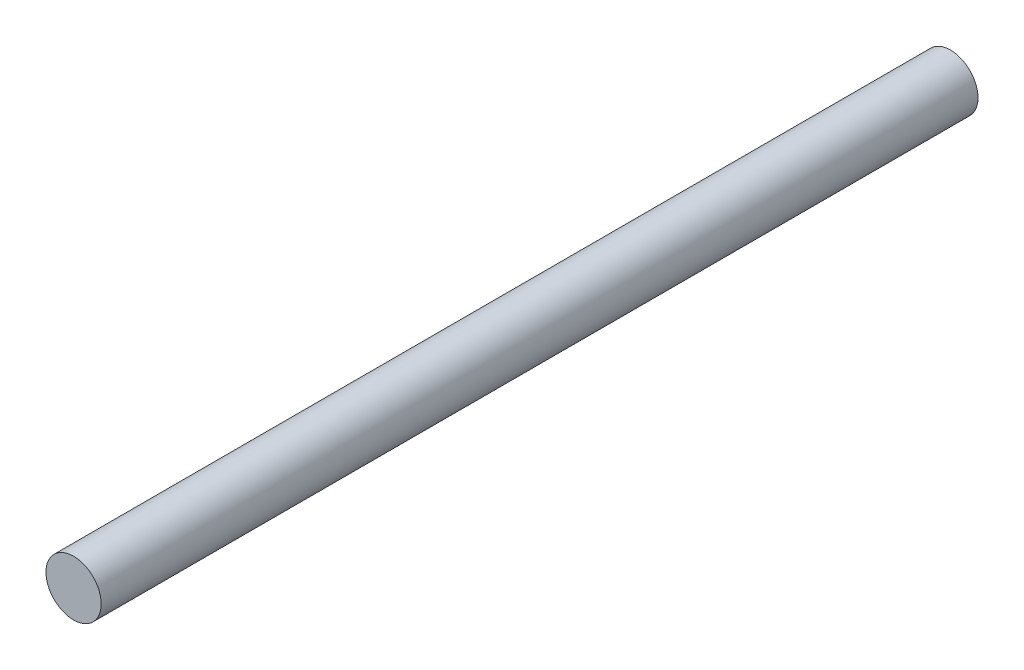
ISO-10303-21;
HEADER;
FILE_DESCRIPTION(('STEP AP214'),'2;1');
FILE_NAME('part.step','',(''),(''),'','','');
FILE_SCHEMA(('AUTOMOTIVE_DESIGN { 1 0 10303 214 1 1 1 1 }'));
ENDSEC;
DATA;
#1=APPLICATION_CONTEXT('core data for automotive mechanical design processes');
#2=APPLICATION_PROTOCOL_DEFINITION('international standard','automotive_design',2000,#1);
#3=PRODUCT_CONTEXT('',#1,'mechanical');
#4=PRODUCT('Part','Part','',(#3));
#5=PRODUCT_RELATED_PRODUCT_CATEGORY('part','',(#4));
#6=PRODUCT_DEFINITION_FORMATION('','',#4);
#7=PRODUCT_DEFINITION_CONTEXT('part definition',#1,'design');
#8=PRODUCT_DEFINITION('design','',#6,#7);
#9=PRODUCT_DEFINITION_SHAPE('','',#8);
#10=(LENGTH_UNIT() NAMED_UNIT(*) SI_UNIT(.MILLI.,.METRE.));
#11=(NAMED_UNIT(*) PLANE_ANGLE_UNIT() SI_UNIT($,.RADIAN.));
#12=(NAMED_UNIT(*) SI_UNIT($,.STERADIAN.) SOLID_ANGLE_UNIT());
#13=UNCERTAINTY_MEASURE_WITH_UNIT(LENGTH_MEASURE(1.E-05),#10,'distance_accuracy_value','');
#14=(GEOMETRIC_REPRESENTATION_CONTEXT(3) GLOBAL_UNCERTAINTY_ASSIGNED_CONTEXT((#13)) GLOBAL_UNIT_ASSIGNED_CONTEXT((#10,
#11,#12)) REPRESENTATION_CONTEXT('',''));
#15=CARTESIAN_POINT('',(0.,0.,0.));
#16=DIRECTION('',(0.,0.,1.));
#17=DIRECTION('',(1.,0.,0.));
#18=AXIS2_PLACEMENT_3D('',#15,#16,#17);
#19=CARTESIAN_POINT('',(0.,0.,127.));
#20=DIRECTION('',(0.,0.,-1.));
#21=DIRECTION('',(-1.,0.,0.));
#22=AXIS2_PLACEMENT_3D('',#19,#20,#21);
#23=CYLINDRICAL_SURFACE('',#22,4.);
#24=CARTESIAN_POINT('',(0.,0.,127.));
#25=DIRECTION('',(0.,0.,1.));
#26=DIRECTION('',(1.,0.,0.));
#27=AXIS2_PLACEMENT_3D('',#24,#25,#26);
#28=CIRCLE('',#27,4.);
#29=CARTESIAN_POINT('',(4.,0.,127.));
#30=VERTEX_POINT('',#29);
#31=EDGE_CURVE('E10',#30,#30,#28,.T.);
#32=ORIENTED_EDGE('',*,*,#31,.F.);
#33=EDGE_LOOP('',(#32));
#34=FACE_BOUND('',#33,.T.);
#35=CARTESIAN_POINT('',(0.,0.,0.));
#36=DIRECTION('',(0.,0.,1.));
#37=DIRECTION('',(1.,0.,0.));
#38=AXIS2_PLACEMENT_3D('',#35,#36,#37);
#39=CIRCLE('',#38,4.);
#40=CARTESIAN_POINT('',(4.,0.,0.));
#41=VERTEX_POINT('',#40);
#42=EDGE_CURVE('E40',#41,#41,#39,.T.);
#43=ORIENTED_EDGE('',*,*,#42,.T.);
#44=EDGE_LOOP('',(#43));
#45=FACE_BOUND('',#44,.T.);
#46=ADVANCED_FACE('F37',(#34,#45),#23,.T.);
#47=CARTESIAN_POINT('',(0.,0.,127.));
#48=DIRECTION('',(0.,0.,1.));
#49=DIRECTION('',(1.,0.,0.));
#50=AXIS2_PLACEMENT_3D('',#47,#48,#49);
#51=PLANE('',#50);
#52=ORIENTED_EDGE('',*,*,#31,.T.);
#53=EDGE_LOOP('',(#52));
#54=FACE_BOUND('',#53,.T.);
#55=ADVANCED_FACE('F54',(#54),#51,.T.);
#56=CARTESIAN_POINT('',(0.,0.,0.));
#57=DIRECTION('',(0.,0.,1.));
#58=DIRECTION('',(1.,0.,0.));
#59=AXIS2_PLACEMENT_3D('',#56,#57,#58);
#60=PLANE('',#59);
#61=ORIENTED_EDGE('',*,*,#42,.F.);
#62=EDGE_LOOP('',(#61));
#63=FACE_BOUND('',#62,.T.);
#64=ADVANCED_FACE('F52',(#63),#60,.F.);
#65=CLOSED_SHELL('',(#46,#55,#64));
#66=MANIFOLD_SOLID_BREP('B2',#65);
#67=ADVANCED_BREP_SHAPE_REPRESENTATION('',(#18,#66),#14);
#68=SHAPE_DEFINITION_REPRESENTATION(#9,#67);
ENDSEC;
END-ISO-10303-21;
